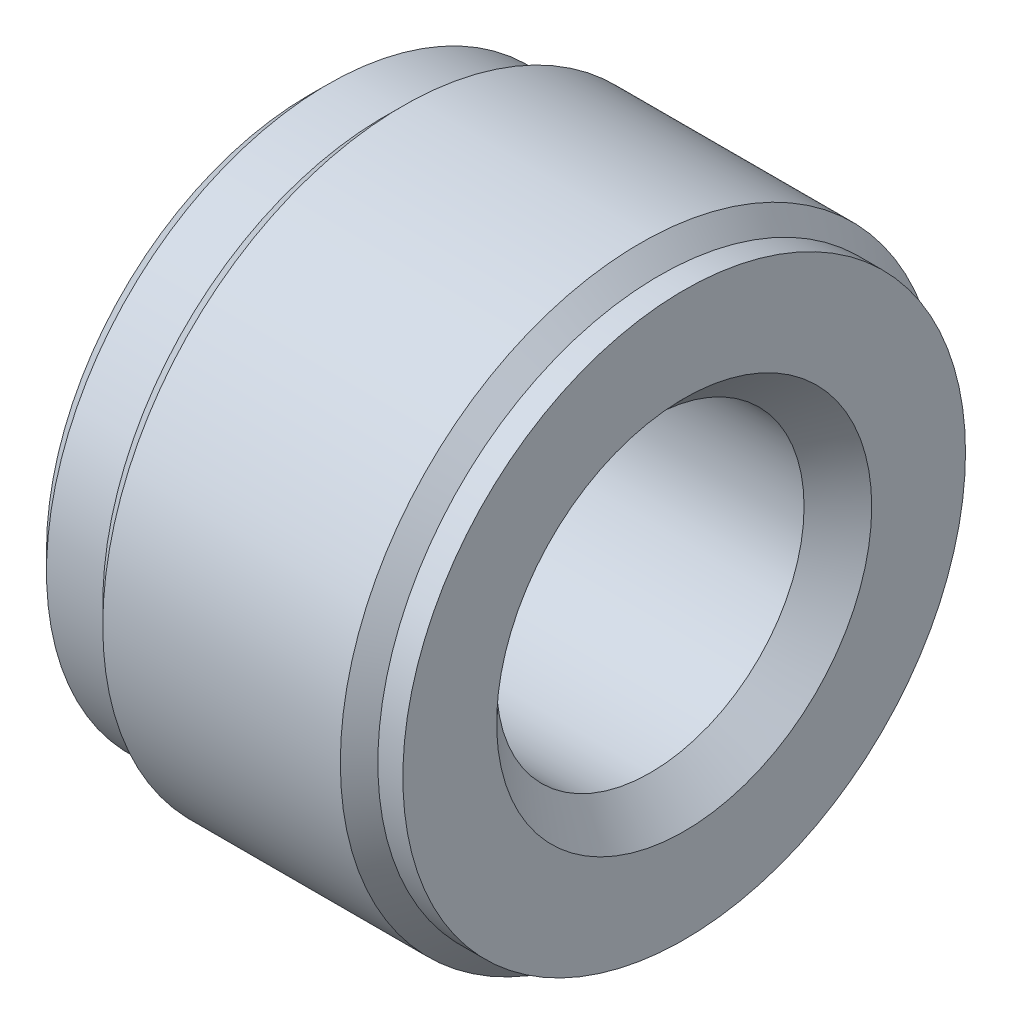
ISO-10303-21;
HEADER;
FILE_DESCRIPTION(('STEP AP214'),'2;1');
FILE_NAME('part.step','',(''),(''),'','','');
FILE_SCHEMA(('AUTOMOTIVE_DESIGN { 1 0 10303 214 1 1 1 1 }'));
ENDSEC;
DATA;
#1=APPLICATION_CONTEXT('core data for automotive mechanical design processes');
#2=APPLICATION_PROTOCOL_DEFINITION('international standard','automotive_design',2000,#1);
#3=PRODUCT_CONTEXT('',#1,'mechanical');
#4=PRODUCT('Part','Part','',(#3));
#5=PRODUCT_RELATED_PRODUCT_CATEGORY('part','',(#4));
#6=PRODUCT_DEFINITION_FORMATION('','',#4);
#7=PRODUCT_DEFINITION_CONTEXT('part definition',#1,'design');
#8=PRODUCT_DEFINITION('design','',#6,#7);
#9=PRODUCT_DEFINITION_SHAPE('','',#8);
#10=(LENGTH_UNIT() NAMED_UNIT(*) SI_UNIT(.MILLI.,.METRE.));
#11=(NAMED_UNIT(*) PLANE_ANGLE_UNIT() SI_UNIT($,.RADIAN.));
#12=(NAMED_UNIT(*) SI_UNIT($,.STERADIAN.) SOLID_ANGLE_UNIT());
#13=UNCERTAINTY_MEASURE_WITH_UNIT(LENGTH_MEASURE(1.E-05),#10,'distance_accuracy_value','');
#14=(GEOMETRIC_REPRESENTATION_CONTEXT(3) GLOBAL_UNCERTAINTY_ASSIGNED_CONTEXT((#13)) GLOBAL_UNIT_ASSIGNED_CONTEXT((#10,
#11,#12)) REPRESENTATION_CONTEXT('',''));
#15=CARTESIAN_POINT('',(0.,0.,0.));
#16=DIRECTION('',(0.,0.,1.));
#17=DIRECTION('',(1.,0.,0.));
#18=AXIS2_PLACEMENT_3D('',#15,#16,#17);
#19=CARTESIAN_POINT('',(0.,0.,0.));
#20=DIRECTION('',(1.,0.,0.));
#21=DIRECTION('',(0.,0.,-1.));
#22=AXIS2_PLACEMENT_3D('',#19,#20,#21);
#23=PLANE('',#22);
#24=CARTESIAN_POINT('',(0.,0.,0.));
#25=DIRECTION('',(1.,0.,0.));
#26=DIRECTION('',(0.,0.,-1.));
#27=AXIS2_PLACEMENT_3D('',#24,#25,#26);
#28=CIRCLE('',#27,2.1);
#29=CARTESIAN_POINT('',(0.,0.,-2.1));
#30=VERTEX_POINT('',#29);
#31=EDGE_CURVE('E49',#30,#30,#28,.T.);
#32=ORIENTED_EDGE('',*,*,#31,.F.);
#33=EDGE_LOOP('',(#32));
#34=FACE_BOUND('',#33,.T.);
#35=CARTESIAN_POINT('',(0.,0.,0.));
#36=DIRECTION('',(1.,0.,0.));
#37=DIRECTION('',(0.,0.,-1.));
#38=AXIS2_PLACEMENT_3D('',#35,#36,#37);
#39=CIRCLE('',#38,1.2295);
#40=CARTESIAN_POINT('',(0.,0.,-1.2295));
#41=VERTEX_POINT('',#40);
#42=EDGE_CURVE('E46',#41,#41,#39,.T.);
#43=ORIENTED_EDGE('',*,*,#42,.T.);
#44=EDGE_LOOP('',(#43));
#45=FACE_BOUND('',#44,.T.);
#46=ADVANCED_FACE('F14',(#34,#45),#23,.F.);
#47=CARTESIAN_POINT('',(0.,0.,0.));
#48=DIRECTION('',(1.,0.,0.));
#49=DIRECTION('',(0.,0.,-1.));
#50=AXIS2_PLACEMENT_3D('',#47,#48,#49);
#51=CONICAL_SURFACE('',#50,2.1,0.785398163397448);
#52=CARTESIAN_POINT('',(0.15,0.,0.));
#53=DIRECTION('',(1.,0.,0.));
#54=DIRECTION('',(0.,0.,-1.));
#55=AXIS2_PLACEMENT_3D('',#52,#53,#54);
#56=CIRCLE('',#55,2.25);
#57=CARTESIAN_POINT('',(0.15,0.,-2.25));
#58=VERTEX_POINT('',#57);
#59=EDGE_CURVE('E43',#58,#58,#56,.T.);
#60=ORIENTED_EDGE('',*,*,#59,.F.);
#61=EDGE_LOOP('',(#60));
#62=FACE_BOUND('',#61,.T.);
#63=ORIENTED_EDGE('',*,*,#31,.T.);
#64=EDGE_LOOP('',(#63));
#65=FACE_BOUND('',#64,.T.);
#66=ADVANCED_FACE('F53',(#62,#65),#51,.T.);
#67=CARTESIAN_POINT('',(3.,0.,0.));
#68=DIRECTION('',(1.,0.,0.));
#69=DIRECTION('',(0.,0.,-1.));
#70=AXIS2_PLACEMENT_3D('',#67,#68,#69);
#71=CYLINDRICAL_SURFACE('',#70,1.2295);
#72=CARTESIAN_POINT('',(2.7295,0.,0.));
#73=DIRECTION('',(1.,0.,0.));
#74=DIRECTION('',(0.,0.,-1.));
#75=AXIS2_PLACEMENT_3D('',#72,#73,#74);
#76=CIRCLE('',#75,1.2295);
#77=CARTESIAN_POINT('',(2.7295,0.,-1.2295));
#78=VERTEX_POINT('',#77);
#79=EDGE_CURVE('E40',#78,#78,#76,.T.);
#80=ORIENTED_EDGE('',*,*,#79,.T.);
#81=EDGE_LOOP('',(#80));
#82=FACE_BOUND('',#81,.T.);
#83=ORIENTED_EDGE('',*,*,#42,.F.);
#84=EDGE_LOOP('',(#83));
#85=FACE_BOUND('',#84,.T.);
#86=ADVANCED_FACE('F60',(#82,#85),#71,.F.);
#87=CARTESIAN_POINT('',(3.,0.,0.));
#88=DIRECTION('',(1.,0.,0.));
#89=DIRECTION('',(0.,0.,-1.));
#90=AXIS2_PLACEMENT_3D('',#87,#88,#89);
#91=CYLINDRICAL_SURFACE('',#90,2.25);
#92=CARTESIAN_POINT('',(0.6,0.,0.));
#93=DIRECTION('',(1.,0.,0.));
#94=DIRECTION('',(0.,0.,-1.));
#95=AXIS2_PLACEMENT_3D('',#92,#93,#94);
#96=CIRCLE('',#95,2.25);
#97=CARTESIAN_POINT('',(0.6,0.,-2.25));
#98=VERTEX_POINT('',#97);
#99=EDGE_CURVE('E37',#98,#98,#96,.T.);
#100=ORIENTED_EDGE('',*,*,#99,.F.);
#101=EDGE_LOOP('',(#100));
#102=FACE_BOUND('',#101,.T.);
#103=ORIENTED_EDGE('',*,*,#59,.T.);
#104=EDGE_LOOP('',(#103));
#105=FACE_BOUND('',#104,.T.);
#106=ADVANCED_FACE('F62',(#102,#105),#91,.T.);
#107=CARTESIAN_POINT('',(2.7295,0.,0.));
#108=DIRECTION('',(1.,0.,0.));
#109=DIRECTION('',(0.,0.,-1.));
#110=AXIS2_PLACEMENT_3D('',#107,#108,#109);
#111=CONICAL_SURFACE('',#110,1.2295,0.785398163397448);
#112=CARTESIAN_POINT('',(3.,0.,0.));
#113=DIRECTION('',(1.,0.,0.));
#114=DIRECTION('',(0.,0.,-1.));
#115=AXIS2_PLACEMENT_3D('',#112,#113,#114);
#116=CIRCLE('',#115,1.5);
#117=CARTESIAN_POINT('',(3.,0.,-1.5));
#118=VERTEX_POINT('',#117);
#119=EDGE_CURVE('E34',#118,#118,#116,.T.);
#120=ORIENTED_EDGE('',*,*,#119,.T.);
#121=EDGE_LOOP('',(#120));
#122=FACE_BOUND('',#121,.T.);
#123=ORIENTED_EDGE('',*,*,#79,.F.);
#124=EDGE_LOOP('',(#123));
#125=FACE_BOUND('',#124,.T.);
#126=ADVANCED_FACE('F70',(#122,#125),#111,.F.);
#127=CARTESIAN_POINT('',(0.6,0.,0.));
#128=DIRECTION('',(1.,0.,0.));
#129=DIRECTION('',(0.,0.,-1.));
#130=AXIS2_PLACEMENT_3D('',#127,#128,#129);
#131=CONICAL_SURFACE('',#130,2.25,0.785398163397446);
#132=CARTESIAN_POINT('',(0.75,0.,0.));
#133=DIRECTION('',(1.,0.,0.));
#134=DIRECTION('',(0.,0.,-1.));
#135=AXIS2_PLACEMENT_3D('',#132,#133,#134);
#136=CIRCLE('',#135,2.4);
#137=CARTESIAN_POINT('',(0.75,0.,-2.4));
#138=VERTEX_POINT('',#137);
#139=EDGE_CURVE('E29',#138,#138,#136,.T.);
#140=ORIENTED_EDGE('',*,*,#139,.F.);
#141=EDGE_LOOP('',(#140));
#142=FACE_BOUND('',#141,.T.);
#143=ORIENTED_EDGE('',*,*,#99,.T.);
#144=EDGE_LOOP('',(#143));
#145=FACE_BOUND('',#144,.T.);
#146=ADVANCED_FACE('F78',(#142,#145),#131,.T.);
#147=CARTESIAN_POINT('',(3.,2.25,0.));
#148=DIRECTION('',(-1.,0.,0.));
#149=DIRECTION('',(0.,0.,1.));
#150=AXIS2_PLACEMENT_3D('',#147,#148,#149);
#151=PLANE('',#150);
#152=ORIENTED_EDGE('',*,*,#119,.F.);
#153=EDGE_LOOP('',(#152));
#154=FACE_BOUND('',#153,.T.);
#155=CARTESIAN_POINT('',(3.,0.,0.));
#156=DIRECTION('',(1.,0.,0.));
#157=DIRECTION('',(0.,0.,-1.));
#158=AXIS2_PLACEMENT_3D('',#155,#156,#157);
#159=CIRCLE('',#158,2.25);
#160=CARTESIAN_POINT('',(3.,0.,-2.25));
#161=VERTEX_POINT('',#160);
#162=EDGE_CURVE('E25',#161,#161,#159,.T.);
#163=ORIENTED_EDGE('',*,*,#162,.T.);
#164=EDGE_LOOP('',(#163));
#165=FACE_BOUND('',#164,.T.);
#166=ADVANCED_FACE('F82',(#154,#165),#151,.F.);
#167=CARTESIAN_POINT('',(3.,0.,0.));
#168=DIRECTION('',(1.,0.,0.));
#169=DIRECTION('',(0.,0.,-1.));
#170=AXIS2_PLACEMENT_3D('',#167,#168,#169);
#171=CYLINDRICAL_SURFACE('',#170,2.4);
#172=CARTESIAN_POINT('',(2.65,0.,0.));
#173=DIRECTION('',(1.,0.,0.));
#174=DIRECTION('',(0.,0.,-1.));
#175=AXIS2_PLACEMENT_3D('',#172,#173,#174);
#176=CIRCLE('',#175,2.4);
#177=CARTESIAN_POINT('',(2.65,0.,-2.4));
#178=VERTEX_POINT('',#177);
#179=EDGE_CURVE('E21',#178,#178,#176,.T.);
#180=ORIENTED_EDGE('',*,*,#179,.F.);
#181=EDGE_LOOP('',(#180));
#182=FACE_BOUND('',#181,.T.);
#183=ORIENTED_EDGE('',*,*,#139,.T.);
#184=EDGE_LOOP('',(#183));
#185=FACE_BOUND('',#184,.T.);
#186=ADVANCED_FACE('F86',(#182,#185),#171,.T.);
#187=CARTESIAN_POINT('',(3.,0.,0.));
#188=DIRECTION('',(1.,0.,0.));
#189=DIRECTION('',(0.,0.,-1.));
#190=AXIS2_PLACEMENT_3D('',#187,#188,#189);
#191=CYLINDRICAL_SURFACE('',#190,2.25);
#192=ORIENTED_EDGE('',*,*,#162,.F.);
#193=EDGE_LOOP('',(#192));
#194=FACE_BOUND('',#193,.T.);
#195=CARTESIAN_POINT('',(2.8,0.,0.));
#196=DIRECTION('',(1.,0.,0.));
#197=DIRECTION('',(0.,0.,-1.));
#198=AXIS2_PLACEMENT_3D('',#195,#196,#197);
#199=CIRCLE('',#198,2.25);
#200=CARTESIAN_POINT('',(2.8,0.,-2.25));
#201=VERTEX_POINT('',#200);
#202=EDGE_CURVE('E9',#201,#201,#199,.T.);
#203=ORIENTED_EDGE('',*,*,#202,.T.);
#204=EDGE_LOOP('',(#203));
#205=FACE_BOUND('',#204,.T.);
#206=ADVANCED_FACE('F89',(#194,#205),#191,.T.);
#207=CARTESIAN_POINT('',(2.65,0.,0.));
#208=DIRECTION('',(-1.,0.,0.));
#209=DIRECTION('',(0.,0.,1.));
#210=AXIS2_PLACEMENT_3D('',#207,#208,#209);
#211=CONICAL_SURFACE('',#210,2.4,0.785398163397445);
#212=ORIENTED_EDGE('',*,*,#202,.F.);
#213=EDGE_LOOP('',(#212));
#214=FACE_BOUND('',#213,.T.);
#215=ORIENTED_EDGE('',*,*,#179,.T.);
#216=EDGE_LOOP('',(#215));
#217=FACE_BOUND('',#216,.T.);
#218=ADVANCED_FACE('F16',(#214,#217),#211,.T.);
#219=CLOSED_SHELL('',(#46,#66,#86,#106,#126,#146,#166,#186,#206,#218));
#220=MANIFOLD_SOLID_BREP('B1',#219);
#221=ADVANCED_BREP_SHAPE_REPRESENTATION('',(#18,#220),#14);
#222=SHAPE_DEFINITION_REPRESENTATION(#9,#221);
ENDSEC;
END-ISO-10303-21;
